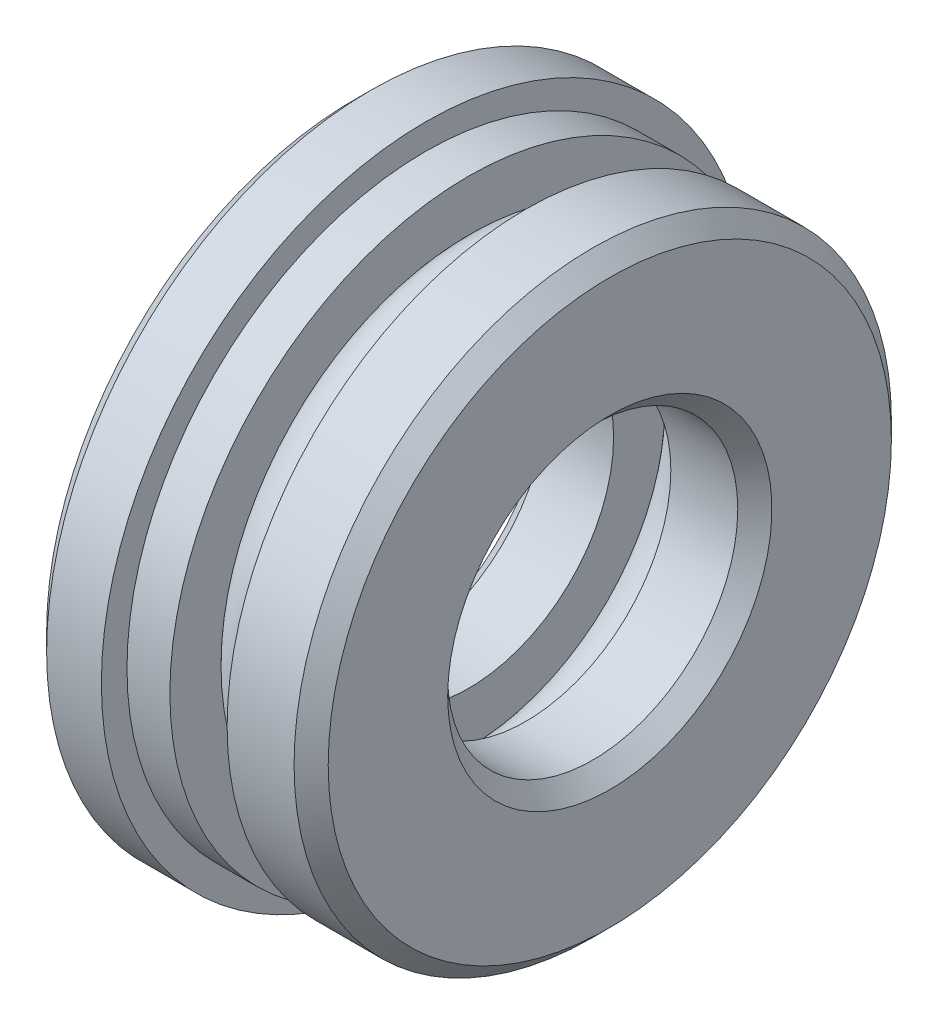
ISO-10303-21;
HEADER;
FILE_DESCRIPTION(('STEP AP214'),'2;1');
FILE_NAME('part.step','',(''),(''),'','','');
FILE_SCHEMA(('AUTOMOTIVE_DESIGN { 1 0 10303 214 1 1 1 1 }'));
ENDSEC;
DATA;
#1=APPLICATION_CONTEXT('core data for automotive mechanical design processes');
#2=APPLICATION_PROTOCOL_DEFINITION('international standard','automotive_design',2000,#1);
#3=PRODUCT_CONTEXT('',#1,'mechanical');
#4=PRODUCT('Part','Part','',(#3));
#5=PRODUCT_RELATED_PRODUCT_CATEGORY('part','',(#4));
#6=PRODUCT_DEFINITION_FORMATION('','',#4);
#7=PRODUCT_DEFINITION_CONTEXT('part definition',#1,'design');
#8=PRODUCT_DEFINITION('design','',#6,#7);
#9=PRODUCT_DEFINITION_SHAPE('','',#8);
#10=(LENGTH_UNIT() NAMED_UNIT(*) SI_UNIT(.MILLI.,.METRE.));
#11=(NAMED_UNIT(*) PLANE_ANGLE_UNIT() SI_UNIT($,.RADIAN.));
#12=(NAMED_UNIT(*) SI_UNIT($,.STERADIAN.) SOLID_ANGLE_UNIT());
#13=UNCERTAINTY_MEASURE_WITH_UNIT(LENGTH_MEASURE(1.E-05),#10,'distance_accuracy_value','');
#14=(GEOMETRIC_REPRESENTATION_CONTEXT(3) GLOBAL_UNCERTAINTY_ASSIGNED_CONTEXT((#13)) GLOBAL_UNIT_ASSIGNED_CONTEXT((#10,
#11,#12)) REPRESENTATION_CONTEXT('',''));
#15=CARTESIAN_POINT('',(0.,0.,0.));
#16=DIRECTION('',(0.,0.,1.));
#17=DIRECTION('',(1.,0.,0.));
#18=AXIS2_PLACEMENT_3D('',#15,#16,#17);
#19=CARTESIAN_POINT('',(8.4,-0.0133040110590031,0.));
#20=DIRECTION('',(-1.,0.,0.));
#21=DIRECTION('',(0.,0.,1.));
#22=AXIS2_PLACEMENT_3D('',#19,#20,#21);
#23=TOROIDAL_SURFACE('',#22,13.,2.25);
#24=CARTESIAN_POINT('',(10.0770509831248,-0.0133040110590031,0.));
#25=DIRECTION('',(-1.,0.,0.));
#26=DIRECTION('',(0.,0.,1.));
#27=AXIS2_PLACEMENT_3D('',#24,#25,#26);
#28=CIRCLE('',#27,11.5);
#29=CARTESIAN_POINT('',(10.0770509831248,-0.0133040110590031,11.5));
#30=VERTEX_POINT('',#29);
#31=EDGE_CURVE('E11',#30,#30,#28,.T.);
#32=ORIENTED_EDGE('',*,*,#31,.F.);
#33=EDGE_LOOP('',(#32));
#34=FACE_BOUND('',#33,.T.);
#35=CARTESIAN_POINT('',(10.0770509831248,-0.0133040110590031,0.));
#36=DIRECTION('',(-1.,0.,0.));
#37=DIRECTION('',(0.,0.,1.));
#38=AXIS2_PLACEMENT_3D('',#35,#36,#37);
#39=CIRCLE('',#38,14.5);
#40=CARTESIAN_POINT('',(10.0770509831248,-0.0133040110590031,14.5));
#41=VERTEX_POINT('',#40);
#42=EDGE_CURVE('E63',#41,#41,#39,.T.);
#43=ORIENTED_EDGE('',*,*,#42,.T.);
#44=EDGE_LOOP('',(#43));
#45=FACE_BOUND('',#44,.T.);
#46=ADVANCED_FACE('F35',(#34,#45),#23,.F.);
#47=CARTESIAN_POINT('',(10.0770509831248,11.486695988941,0.));
#48=DIRECTION('',(1.,0.,0.));
#49=DIRECTION('',(0.,0.,-1.));
#50=AXIS2_PLACEMENT_3D('',#47,#48,#49);
#51=PLANE('',#50);
#52=CARTESIAN_POINT('',(10.0770509831248,-0.0133040110590031,0.));
#53=DIRECTION('',(-1.,0.,0.));
#54=DIRECTION('',(0.,0.,1.));
#55=AXIS2_PLACEMENT_3D('',#52,#53,#54);
#56=CIRCLE('',#55,8.5);
#57=CARTESIAN_POINT('',(10.0770509831248,-0.0133040110590031,8.5));
#58=VERTEX_POINT('',#57);
#59=EDGE_CURVE('E41',#58,#58,#56,.T.);
#60=ORIENTED_EDGE('',*,*,#59,.F.);
#61=EDGE_LOOP('',(#60));
#62=FACE_BOUND('',#61,.T.);
#63=ORIENTED_EDGE('',*,*,#31,.T.);
#64=EDGE_LOOP('',(#63));
#65=FACE_BOUND('',#64,.T.);
#66=ADVANCED_FACE('F100',(#62,#65),#51,.F.);
#67=CARTESIAN_POINT('',(1.80000000000001,-0.0133040110590031,0.));
#68=DIRECTION('',(-1.,0.,0.));
#69=DIRECTION('',(0.,0.,1.));
#70=AXIS2_PLACEMENT_3D('',#67,#68,#69);
#71=CYLINDRICAL_SURFACE('',#70,8.5);
#72=CARTESIAN_POINT('',(14.,-0.0133040110590031,0.));
#73=DIRECTION('',(-1.,0.,0.));
#74=DIRECTION('',(0.,0.,1.));
#75=AXIS2_PLACEMENT_3D('',#72,#73,#74);
#76=CIRCLE('',#75,8.5);
#77=CARTESIAN_POINT('',(14.,-0.0133040110590031,8.5));
#78=VERTEX_POINT('',#77);
#79=EDGE_CURVE('E45',#78,#78,#76,.T.);
#80=ORIENTED_EDGE('',*,*,#79,.F.);
#81=EDGE_LOOP('',(#80));
#82=FACE_BOUND('',#81,.T.);
#83=ORIENTED_EDGE('',*,*,#59,.T.);
#84=EDGE_LOOP('',(#83));
#85=FACE_BOUND('',#84,.T.);
#86=ADVANCED_FACE('F95',(#82,#85),#71,.F.);
#87=CARTESIAN_POINT('',(14.,-0.0133040110590031,0.));
#88=DIRECTION('',(1.,0.,0.));
#89=DIRECTION('',(0.,0.,-1.));
#90=AXIS2_PLACEMENT_3D('',#87,#88,#89);
#91=CONICAL_SURFACE('',#90,8.5,0.785398163397448);
#92=CARTESIAN_POINT('',(15.,-0.0133040110590031,0.));
#93=DIRECTION('',(-1.,0.,0.));
#94=DIRECTION('',(0.,0.,1.));
#95=AXIS2_PLACEMENT_3D('',#92,#93,#94);
#96=CIRCLE('',#95,9.50000000000002);
#97=CARTESIAN_POINT('',(15.,-0.0133040110590031,9.50000000000002));
#98=VERTEX_POINT('',#97);
#99=EDGE_CURVE('E49',#98,#98,#96,.T.);
#100=ORIENTED_EDGE('',*,*,#99,.F.);
#101=EDGE_LOOP('',(#100));
#102=FACE_BOUND('',#101,.T.);
#103=ORIENTED_EDGE('',*,*,#79,.T.);
#104=EDGE_LOOP('',(#103));
#105=FACE_BOUND('',#104,.T.);
#106=ADVANCED_FACE('F89',(#102,#105),#91,.F.);
#107=CARTESIAN_POINT('',(15.,9.48669598894101,0.));
#108=DIRECTION('',(-1.,0.,0.));
#109=DIRECTION('',(0.,0.,1.));
#110=AXIS2_PLACEMENT_3D('',#107,#108,#109);
#111=PLANE('',#110);
#112=CARTESIAN_POINT('',(15.,-0.0133040110590031,0.));
#113=DIRECTION('',(-1.,0.,0.));
#114=DIRECTION('',(0.,0.,1.));
#115=AXIS2_PLACEMENT_3D('',#112,#113,#114);
#116=CIRCLE('',#115,16.5);
#117=CARTESIAN_POINT('',(15.,-0.0133040110590031,16.5));
#118=VERTEX_POINT('',#117);
#119=EDGE_CURVE('E54',#118,#118,#116,.T.);
#120=ORIENTED_EDGE('',*,*,#119,.F.);
#121=EDGE_LOOP('',(#120));
#122=FACE_BOUND('',#121,.T.);
#123=ORIENTED_EDGE('',*,*,#99,.T.);
#124=EDGE_LOOP('',(#123));
#125=FACE_BOUND('',#124,.T.);
#126=ADVANCED_FACE('F83',(#122,#125),#111,.F.);
#127=CARTESIAN_POINT('',(15.,-0.0133040110590031,0.));
#128=DIRECTION('',(-1.,0.,0.));
#129=DIRECTION('',(0.,0.,1.));
#130=AXIS2_PLACEMENT_3D('',#127,#128,#129);
#131=CONICAL_SURFACE('',#130,16.5,0.785398163397445);
#132=CARTESIAN_POINT('',(14.,-0.0133040110590031,0.));
#133=DIRECTION('',(-1.,0.,0.));
#134=DIRECTION('',(0.,0.,1.));
#135=AXIS2_PLACEMENT_3D('',#132,#133,#134);
#136=CIRCLE('',#135,17.5);
#137=CARTESIAN_POINT('',(14.,-0.0133040110590031,17.5));
#138=VERTEX_POINT('',#137);
#139=EDGE_CURVE('E57',#138,#138,#136,.T.);
#140=ORIENTED_EDGE('',*,*,#139,.F.);
#141=EDGE_LOOP('',(#140));
#142=FACE_BOUND('',#141,.T.);
#143=ORIENTED_EDGE('',*,*,#119,.T.);
#144=EDGE_LOOP('',(#143));
#145=FACE_BOUND('',#144,.T.);
#146=ADVANCED_FACE('F77',(#142,#145),#131,.T.);
#147=CARTESIAN_POINT('',(1.80000000000001,-0.0133040110590031,0.));
#148=DIRECTION('',(-1.,0.,0.));
#149=DIRECTION('',(0.,0.,1.));
#150=AXIS2_PLACEMENT_3D('',#147,#148,#149);
#151=CYLINDRICAL_SURFACE('',#150,17.5);
#152=CARTESIAN_POINT('',(10.0770509831248,-0.0133040110590031,0.));
#153=DIRECTION('',(-1.,0.,0.));
#154=DIRECTION('',(0.,0.,1.));
#155=AXIS2_PLACEMENT_3D('',#152,#153,#154);
#156=CIRCLE('',#155,17.5);
#157=CARTESIAN_POINT('',(10.0770509831248,-0.0133040110590031,17.5));
#158=VERTEX_POINT('',#157);
#159=EDGE_CURVE('E60',#158,#158,#156,.T.);
#160=ORIENTED_EDGE('',*,*,#159,.F.);
#161=EDGE_LOOP('',(#160));
#162=FACE_BOUND('',#161,.T.);
#163=ORIENTED_EDGE('',*,*,#139,.T.);
#164=EDGE_LOOP('',(#163));
#165=FACE_BOUND('',#164,.T.);
#166=ADVANCED_FACE('F71',(#162,#165),#151,.T.);
#167=CARTESIAN_POINT('',(10.0770509831248,14.486695988941,0.));
#168=DIRECTION('',(1.,0.,0.));
#169=DIRECTION('',(0.,0.,-1.));
#170=AXIS2_PLACEMENT_3D('',#167,#168,#169);
#171=PLANE('',#170);
#172=ORIENTED_EDGE('',*,*,#42,.F.);
#173=EDGE_LOOP('',(#172));
#174=FACE_BOUND('',#173,.T.);
#175=ORIENTED_EDGE('',*,*,#159,.T.);
#176=EDGE_LOOP('',(#175));
#177=FACE_BOUND('',#176,.T.);
#178=ADVANCED_FACE('F68',(#174,#177),#171,.F.);
#179=CLOSED_SHELL('',(#46,#66,#86,#106,#126,#146,#166,#178));
#180=MANIFOLD_SOLID_BREP('B2',#179);
#181=CARTESIAN_POINT('',(8.4,-0.0133040110590031,0.));
#182=DIRECTION('',(-1.,0.,0.));
#183=DIRECTION('',(0.,0.,1.));
#184=AXIS2_PLACEMENT_3D('',#181,#182,#183);
#185=TOROIDAL_SURFACE('',#184,13.,2.25);
#186=CARTESIAN_POINT('',(8.4,-0.0133040110590031,15.25));
#187=VERTEX_POINT('',#186);
#188=VERTEX_LOOP('',#187);
#189=FACE_BOUND('',#188,.T.);
#190=ADVANCED_FACE('F164',(#189),#185,.T.);
#191=CLOSED_SHELL('',(#190));
#192=MANIFOLD_SOLID_BREP('B6',#191);
#193=CARTESIAN_POINT('',(31.,-0.0133040110590031,0.));
#194=DIRECTION('',(-1.,0.,0.));
#195=DIRECTION('',(0.,1.,0.));
#196=AXIS2_PLACEMENT_3D('',#193,#194,#195);
#197=SPHERICAL_SURFACE('',#196,32.);
#198=CARTESIAN_POINT('',(1.80000000000001,-0.0133040110590031,0.));
#199=DIRECTION('',(-1.,0.,0.));
#200=DIRECTION('',(0.,0.,1.));
#201=AXIS2_PLACEMENT_3D('',#198,#199,#200);
#202=CIRCLE('',#201,13.0904545375629);
#203=CARTESIAN_POINT('',(1.80000000000001,13.0771505265039,0.));
#204=VERTEX_POINT('',#203);
#205=EDGE_CURVE('E163',#204,#204,#202,.T.);
#206=CARTESIAN_POINT('',(4.20914335076239,-0.0133040110590031,0.));
#207=DIRECTION('',(-1.,0.,0.));
#208=DIRECTION('',(0.,0.,1.));
#209=AXIS2_PLACEMENT_3D('',#206,#207,#208);
#210=CIRCLE('',#209,17.5);
#211=CARTESIAN_POINT('',(4.20914335076239,17.486695988941,0.));
#212=VERTEX_POINT('',#211);
#213=EDGE_CURVE('E211',#212,#212,#210,.T.);
#214=CARTESIAN_POINT('',(1.80000000000001,13.0771505265039,0.));
#215=CARTESIAN_POINT('',(1.8214335796401,13.124960979485,0.));
#216=CARTESIAN_POINT('',(1.84298458452997,13.1727187903362,0.));
#217=CARTESIAN_POINT('',(1.88632092036724,13.2681279775024,0.));
#218=CARTESIAN_POINT('',(1.90810625131463,13.3157793538175,0.));
#219=CARTESIAN_POINT('',(1.95191071482488,13.4109745216357,0.));
#220=CARTESIAN_POINT('',(1.97392984738773,13.4585183131388,0.));
#221=CARTESIAN_POINT('',(2.01820138253074,13.5534971643409,0.));
#222=CARTESIAN_POINT('',(2.0404537851109,13.60093222404,0.));
#223=CARTESIAN_POINT('',(2.08519132346794,13.6956924670813,0.));
#224=CARTESIAN_POINT('',(2.10767645924481,13.7430176504234,0.));
#225=CARTESIAN_POINT('',(2.15287892145055,13.8375569988984,0.));
#226=CARTESIAN_POINT('',(2.1755962478794,13.8847711640312,0.));
#227=CARTESIAN_POINT('',(2.22126254327121,13.9790873369005,0.));
#228=CARTESIAN_POINT('',(2.24421151223416,14.0261893446369,0.));
#229=CARTESIAN_POINT('',(2.29034053897936,14.1202800662361,0.));
#230=CARTESIAN_POINT('',(2.31352059676162,14.1672687800989,0.));
#231=CARTESIAN_POINT('',(2.36011124185704,14.261131780206,0.));
#232=CARTESIAN_POINT('',(2.38352182917021,14.3080060664504,0.));
#233=CARTESIAN_POINT('',(2.43057296847626,14.4016390803371,0.));
#234=CARTESIAN_POINT('',(2.45421352046915,14.4483978079796,0.));
#235=CARTESIAN_POINT('',(2.50172401873504,14.541798576467,0.));
#236=CARTESIAN_POINT('',(2.52559396500803,14.588440617312,0.));
#237=CARTESIAN_POINT('',(2.57356267589963,14.6816068868248,0.));
#238=CARTESIAN_POINT('',(2.59766144051824,14.7281311154924,0.));
#239=CARTESIAN_POINT('',(2.64608720664564,14.821060638113,0.));
#240=CARTESIAN_POINT('',(2.67041420815444,14.867465932066,0.));
#241=CARTESIAN_POINT('',(2.7192958610999,14.9601564655893,0.));
#242=CARTESIAN_POINT('',(2.74385051253657,15.0064417051597,0.));
#243=CARTESIAN_POINT('',(2.79318687288271,15.0988910131469,0.));
#244=CARTESIAN_POINT('',(2.81796858179219,15.1450550815637,0.));
#245=CARTESIAN_POINT('',(2.86775845915044,15.2372609333963,0.));
#246=CARTESIAN_POINT('',(2.89276662759921,15.283302716812,0.));
#247=CARTESIAN_POINT('',(2.94300882063853,15.3752628877455,0.));
#248=CARTESIAN_POINT('',(2.96824284522908,15.4211812752633,0.));
#249=CARTESIAN_POINT('',(3.01893614170494,15.5128935464811,0.));
#250=CARTESIAN_POINT('',(3.04439541359026,15.5586874301811,0.));
#251=CARTESIAN_POINT('',(3.09553859037392,15.6501495888479,0.));
#252=CARTESIAN_POINT('',(3.12122249527226,15.6958178638147,0.));
#253=CARTESIAN_POINT('',(3.17281431838023,15.7870277031299,0.));
#254=CARTESIAN_POINT('',(3.19872223658987,15.8325692674784,0.));
#255=CARTESIAN_POINT('',(3.25076146121376,15.9235245867295,0.));
#256=CARTESIAN_POINT('',(3.276892767628,15.9689383416321,0.));
#257=CARTESIAN_POINT('',(3.32937813816446,16.0596369462474,0.));
#258=CARTESIAN_POINT('',(3.35573220228667,16.1049217959602,0.));
#259=CARTESIAN_POINT('',(3.40866245236776,16.1953614975622,0.));
#260=CARTESIAN_POINT('',(3.43523863832663,16.2405163494516,0.));
#261=CARTESIAN_POINT('',(3.48861249085032,16.3306949659097,0.));
#262=CARTESIAN_POINT('',(3.51541015741514,16.3757187304785,0.));
#263=CARTESIAN_POINT('',(3.56922632457626,16.4656340859613,0.));
#264=CARTESIAN_POINT('',(3.59624482517256,16.5105256768753,0.));
#265=CARTESIAN_POINT('',(3.65050200849337,16.6001756019038,0.));
#266=CARTESIAN_POINT('',(3.67774069121789,16.6449339360183,0.));
#267=CARTESIAN_POINT('',(3.73243758158123,16.7343162675167,0.));
#268=CARTESIAN_POINT('',(3.75989578922007,16.7789402649007,0.));
#269=CARTESIAN_POINT('',(3.81503106689425,16.8680528462532,0.));
#270=CARTESIAN_POINT('',(3.84270813692961,16.9125414302218,0.));
#271=CARTESIAN_POINT('',(3.89828047162521,17.0013821113086,0.));
#272=CARTESIAN_POINT('',(3.92617573628545,17.0457342084268,0.));
#273=CARTESIAN_POINT('',(3.98218378709425,17.1343008457357,0.));
#274=CARTESIAN_POINT('',(4.01029657324282,17.1785153859264,0.));
#275=CARTESIAN_POINT('',(4.06673898901778,17.2668058423803,0.));
#276=CARTESIAN_POINT('',(4.09506861864419,17.3108817586435,0.));
#277=CARTESIAN_POINT('',(4.15194403673487,17.3988939044901,0.));
#278=CARTESIAN_POINT('',(4.18048982519915,17.4428301340736,0.));
#279=CARTESIAN_POINT('',(4.20914335076239,17.486695988941,0.));
#280=B_SPLINE_CURVE_WITH_KNOTS('',3,(#214,#215,#216,#217,#218,#219,#220,#221,#222,#223,#224,
#225,#226,#227,#228,#229,#230,#231,#232,#233,#234,#235,#236,#237,#238,#239,#240,#241,#242,#243,
#244,#245,#246,#247,#248,#249,#250,#251,#252,#253,#254,#255,#256,#257,#258,#259,#260,#261,#262,
#263,#264,#265,#266,#267,#268,#269,#270,#271,#272,#273,#274,#275,#276,#277,#278,#279),
.UNSPECIFIED.,.F.,.F.,(4,2,2,2,2,2,2,2,2,2,2,2,2,2,2,2,2,2,2,2,2,2,2,2,2,2,2,2,2,2,2,2,4),(0.,
0.157184891357785,0.314369782715567,0.471554674073345,0.628739565431128,0.785924456788912,
0.943109348146689,1.10029423950447,1.25747913086226,1.41466402222004,1.57184891357782,
1.7290338049356,1.88621869629339,2.04340358765117,2.20058847900894,2.35777337036673,
2.51495826172451,2.67214315308229,2.82932804444008,2.98651293579786,3.14369782715564,
3.30088271851342,3.4580676098712,3.61525250122898,3.77243739258677,3.92962228394455,
4.08680717530233,4.24399206666011,4.40117695801789,4.55836184937568,4.71554674073345,
4.87273163209124,5.02991652344902),.UNSPECIFIED.);
#281=EDGE_CURVE('BSEAM183',#204,#212,#280,.T.);
#282=ORIENTED_EDGE('',*,*,#205,.F.);
#283=ORIENTED_EDGE('',*,*,#213,.T.);
#284=ORIENTED_EDGE('',*,*,#281,.T.);
#285=ORIENTED_EDGE('',*,*,#281,.F.);
#286=EDGE_LOOP('',(#282,#284,#283,#285));
#287=FACE_BOUND('',#286,.T.);
#288=ADVANCED_FACE('F183',(#287),#197,.T.);
#289=CARTESIAN_POINT('',(1.80000000000001,9.48669598894099,0.));
#290=DIRECTION('',(1.,0.,0.));
#291=DIRECTION('',(0.,0.,-1.));
#292=AXIS2_PLACEMENT_3D('',#289,#290,#291);
#293=PLANE('',#292);
#294=CARTESIAN_POINT('',(1.80000000000001,-0.0133040110590031,0.));
#295=DIRECTION('',(-1.,0.,0.));
#296=DIRECTION('',(0.,0.,1.));
#297=AXIS2_PLACEMENT_3D('',#294,#295,#296);
#298=CIRCLE('',#297,9.49999999999999);
#299=CARTESIAN_POINT('',(1.80000000000001,-0.0133040110590031,9.49999999999999));
#300=VERTEX_POINT('',#299);
#301=EDGE_CURVE('E189',#300,#300,#298,.T.);
#302=ORIENTED_EDGE('',*,*,#301,.F.);
#303=EDGE_LOOP('',(#302));
#304=FACE_BOUND('',#303,.T.);
#305=ORIENTED_EDGE('',*,*,#205,.T.);
#306=EDGE_LOOP('',(#305));
#307=FACE_BOUND('',#306,.T.);
#308=ADVANCED_FACE('F248',(#304,#307),#293,.F.);
#309=CARTESIAN_POINT('',(1.80000000000001,-0.0133040110590031,0.));
#310=DIRECTION('',(-1.,0.,0.));
#311=DIRECTION('',(0.,0.,1.));
#312=AXIS2_PLACEMENT_3D('',#309,#310,#311);
#313=CONICAL_SURFACE('',#312,9.49999999999999,0.785398163397448);
#314=CARTESIAN_POINT('',(2.8,-0.0133040110590031,0.));
#315=DIRECTION('',(-1.,0.,0.));
#316=DIRECTION('',(0.,0.,1.));
#317=AXIS2_PLACEMENT_3D('',#314,#315,#316);
#318=CIRCLE('',#317,8.5);
#319=CARTESIAN_POINT('',(2.8,-0.0133040110590031,8.5));
#320=VERTEX_POINT('',#319);
#321=EDGE_CURVE('E193',#320,#320,#318,.T.);
#322=ORIENTED_EDGE('',*,*,#321,.F.);
#323=EDGE_LOOP('',(#322));
#324=FACE_BOUND('',#323,.T.);
#325=ORIENTED_EDGE('',*,*,#301,.T.);
#326=EDGE_LOOP('',(#325));
#327=FACE_BOUND('',#326,.T.);
#328=ADVANCED_FACE('F243',(#324,#327),#313,.F.);
#329=CARTESIAN_POINT('',(1.80000000000001,-0.0133040110590031,0.));
#330=DIRECTION('',(-1.,0.,0.));
#331=DIRECTION('',(0.,0.,1.));
#332=AXIS2_PLACEMENT_3D('',#329,#330,#331);
#333=CYLINDRICAL_SURFACE('',#332,8.5);
#334=CARTESIAN_POINT('',(6.72294901687516,-0.0133040110590031,0.));
#335=DIRECTION('',(-1.,0.,0.));
#336=DIRECTION('',(0.,0.,1.));
#337=AXIS2_PLACEMENT_3D('',#334,#335,#336);
#338=CIRCLE('',#337,8.5);
#339=CARTESIAN_POINT('',(6.72294901687516,-0.0133040110590031,8.5));
#340=VERTEX_POINT('',#339);
#341=EDGE_CURVE('E197',#340,#340,#338,.T.);
#342=ORIENTED_EDGE('',*,*,#341,.F.);
#343=EDGE_LOOP('',(#342));
#344=FACE_BOUND('',#343,.T.);
#345=ORIENTED_EDGE('',*,*,#321,.T.);
#346=EDGE_LOOP('',(#345));
#347=FACE_BOUND('',#346,.T.);
#348=ADVANCED_FACE('F237',(#344,#347),#333,.F.);
#349=CARTESIAN_POINT('',(6.72294901687516,11.486695988941,0.));
#350=DIRECTION('',(-1.,0.,0.));
#351=DIRECTION('',(0.,0.,1.));
#352=AXIS2_PLACEMENT_3D('',#349,#350,#351);
#353=PLANE('',#352);
#354=CARTESIAN_POINT('',(6.72294901687516,-0.0133040110590031,0.));
#355=DIRECTION('',(-1.,0.,0.));
#356=DIRECTION('',(0.,0.,1.));
#357=AXIS2_PLACEMENT_3D('',#354,#355,#356);
#358=CIRCLE('',#357,11.5);
#359=CARTESIAN_POINT('',(6.72294901687516,-0.0133040110590031,11.5));
#360=VERTEX_POINT('',#359);
#361=EDGE_CURVE('E202',#360,#360,#358,.T.);
#362=ORIENTED_EDGE('',*,*,#361,.F.);
#363=EDGE_LOOP('',(#362));
#364=FACE_BOUND('',#363,.T.);
#365=ORIENTED_EDGE('',*,*,#341,.T.);
#366=EDGE_LOOP('',(#365));
#367=FACE_BOUND('',#366,.T.);
#368=ADVANCED_FACE('F231',(#364,#367),#353,.F.);
#369=CARTESIAN_POINT('',(8.4,-0.0133040110590031,0.));
#370=DIRECTION('',(-1.,0.,0.));
#371=DIRECTION('',(0.,0.,1.));
#372=AXIS2_PLACEMENT_3D('',#369,#370,#371);
#373=TOROIDAL_SURFACE('',#372,13.,2.25);
#374=CARTESIAN_POINT('',(6.72294901687516,-0.0133040110590031,0.));
#375=DIRECTION('',(-1.,0.,0.));
#376=DIRECTION('',(0.,0.,1.));
#377=AXIS2_PLACEMENT_3D('',#374,#375,#376);
#378=CIRCLE('',#377,14.5);
#379=CARTESIAN_POINT('',(6.72294901687516,-0.0133040110590031,14.5));
#380=VERTEX_POINT('',#379);
#381=EDGE_CURVE('E205',#380,#380,#378,.T.);
#382=ORIENTED_EDGE('',*,*,#381,.F.);
#383=EDGE_LOOP('',(#382));
#384=FACE_BOUND('',#383,.T.);
#385=ORIENTED_EDGE('',*,*,#361,.T.);
#386=EDGE_LOOP('',(#385));
#387=FACE_BOUND('',#386,.T.);
#388=ADVANCED_FACE('F225',(#384,#387),#373,.F.);
#389=CARTESIAN_POINT('',(6.72294901687516,14.486695988941,0.));
#390=DIRECTION('',(-1.,0.,0.));
#391=DIRECTION('',(0.,0.,1.));
#392=AXIS2_PLACEMENT_3D('',#389,#390,#391);
#393=PLANE('',#392);
#394=CARTESIAN_POINT('',(6.72294901687516,-0.0133040110590031,0.));
#395=DIRECTION('',(-1.,0.,0.));
#396=DIRECTION('',(0.,0.,1.));
#397=AXIS2_PLACEMENT_3D('',#394,#395,#396);
#398=CIRCLE('',#397,17.5);
#399=CARTESIAN_POINT('',(6.72294901687516,-0.0133040110590031,17.5));
#400=VERTEX_POINT('',#399);
#401=EDGE_CURVE('E208',#400,#400,#398,.T.);
#402=ORIENTED_EDGE('',*,*,#401,.F.);
#403=EDGE_LOOP('',(#402));
#404=FACE_BOUND('',#403,.T.);
#405=ORIENTED_EDGE('',*,*,#381,.T.);
#406=EDGE_LOOP('',(#405));
#407=FACE_BOUND('',#406,.T.);
#408=ADVANCED_FACE('F219',(#404,#407),#393,.F.);
#409=CARTESIAN_POINT('',(1.80000000000001,-0.0133040110590031,0.));
#410=DIRECTION('',(-1.,0.,0.));
#411=DIRECTION('',(0.,0.,1.));
#412=AXIS2_PLACEMENT_3D('',#409,#410,#411);
#413=CYLINDRICAL_SURFACE('',#412,17.5);
#414=ORIENTED_EDGE('',*,*,#213,.F.);
#415=EDGE_LOOP('',(#414));
#416=FACE_BOUND('',#415,.T.);
#417=ORIENTED_EDGE('',*,*,#401,.T.);
#418=EDGE_LOOP('',(#417));
#419=FACE_BOUND('',#418,.T.);
#420=ADVANCED_FACE('F216',(#416,#419),#413,.T.);
#421=CLOSED_SHELL('',(#288,#308,#328,#348,#368,#388,#408,#420));
#422=MANIFOLD_SOLID_BREP('B31',#421);
#423=CARTESIAN_POINT('',(31.,-0.0133040110590031,0.));
#424=DIRECTION('',(-1.,0.,0.));
#425=DIRECTION('',(0.,1.,0.));
#426=AXIS2_PLACEMENT_3D('',#423,#424,#425);
#427=SPHERICAL_SURFACE('',#426,32.);
#428=CARTESIAN_POINT('',(4.20914335076239,-0.0133040110590031,0.));
#429=DIRECTION('',(-1.,0.,0.));
#430=DIRECTION('',(0.,0.,1.));
#431=AXIS2_PLACEMENT_3D('',#428,#429,#430);
#432=CIRCLE('',#431,17.5);
#433=CARTESIAN_POINT('',(4.20914335076239,17.486695988941,0.));
#434=VERTEX_POINT('',#433);
#435=EDGE_CURVE('E182',#434,#434,#432,.T.);
#436=CARTESIAN_POINT('',(1.80000000000001,-0.0133040110590031,0.));
#437=DIRECTION('',(-1.,0.,0.));
#438=DIRECTION('',(0.,0.,1.));
#439=AXIS2_PLACEMENT_3D('',#436,#437,#438);
#440=CIRCLE('',#439,13.0904545375629);
#441=CARTESIAN_POINT('',(1.80000000000001,13.0771505265039,0.));
#442=VERTEX_POINT('',#441);
#443=EDGE_CURVE('E326',#442,#442,#440,.T.);
#444=CARTESIAN_POINT('',(4.20914335076239,17.486695988941,0.));
#445=CARTESIAN_POINT('',(4.18048982519915,17.4428301340736,0.));
#446=CARTESIAN_POINT('',(4.15194403673487,17.3988939044901,0.));
#447=CARTESIAN_POINT('',(4.09506861864419,17.3108817586435,0.));
#448=CARTESIAN_POINT('',(4.06673898901778,17.2668058423803,0.));
#449=CARTESIAN_POINT('',(4.01029657324282,17.1785153859264,0.));
#450=CARTESIAN_POINT('',(3.98218378709425,17.1343008457357,0.));
#451=CARTESIAN_POINT('',(3.92617573628545,17.0457342084268,0.));
#452=CARTESIAN_POINT('',(3.89828047162521,17.0013821113086,0.));
#453=CARTESIAN_POINT('',(3.84270813692961,16.9125414302218,0.));
#454=CARTESIAN_POINT('',(3.81503106689425,16.8680528462532,0.));
#455=CARTESIAN_POINT('',(3.75989578922007,16.7789402649007,0.));
#456=CARTESIAN_POINT('',(3.73243758158123,16.7343162675167,0.));
#457=CARTESIAN_POINT('',(3.67774069121789,16.6449339360183,0.));
#458=CARTESIAN_POINT('',(3.65050200849337,16.6001756019038,0.));
#459=CARTESIAN_POINT('',(3.59624482517256,16.5105256768753,0.));
#460=CARTESIAN_POINT('',(3.56922632457626,16.4656340859613,0.));
#461=CARTESIAN_POINT('',(3.51541015741514,16.3757187304785,0.));
#462=CARTESIAN_POINT('',(3.48861249085032,16.3306949659097,0.));
#463=CARTESIAN_POINT('',(3.43523863832663,16.2405163494516,0.));
#464=CARTESIAN_POINT('',(3.40866245236776,16.1953614975622,0.));
#465=CARTESIAN_POINT('',(3.35573220228667,16.1049217959602,0.));
#466=CARTESIAN_POINT('',(3.32937813816446,16.0596369462474,0.));
#467=CARTESIAN_POINT('',(3.276892767628,15.9689383416321,0.));
#468=CARTESIAN_POINT('',(3.25076146121376,15.9235245867295,0.));
#469=CARTESIAN_POINT('',(3.19872223658987,15.8325692674784,0.));
#470=CARTESIAN_POINT('',(3.17281431838023,15.7870277031299,0.));
#471=CARTESIAN_POINT('',(3.12122249527226,15.6958178638147,0.));
#472=CARTESIAN_POINT('',(3.09553859037392,15.6501495888479,0.));
#473=CARTESIAN_POINT('',(3.04439541359026,15.5586874301811,0.));
#474=CARTESIAN_POINT('',(3.01893614170494,15.5128935464811,0.));
#475=CARTESIAN_POINT('',(2.96824284522908,15.4211812752633,0.));
#476=CARTESIAN_POINT('',(2.94300882063853,15.3752628877455,0.));
#477=CARTESIAN_POINT('',(2.89276662759921,15.283302716812,0.));
#478=CARTESIAN_POINT('',(2.86775845915044,15.2372609333963,0.));
#479=CARTESIAN_POINT('',(2.81796858179219,15.1450550815637,0.));
#480=CARTESIAN_POINT('',(2.79318687288271,15.0988910131469,0.));
#481=CARTESIAN_POINT('',(2.74385051253657,15.0064417051597,0.));
#482=CARTESIAN_POINT('',(2.7192958610999,14.9601564655893,0.));
#483=CARTESIAN_POINT('',(2.67041420815444,14.867465932066,0.));
#484=CARTESIAN_POINT('',(2.64608720664564,14.821060638113,0.));
#485=CARTESIAN_POINT('',(2.59766144051824,14.7281311154924,0.));
#486=CARTESIAN_POINT('',(2.57356267589963,14.6816068868248,0.));
#487=CARTESIAN_POINT('',(2.52559396500803,14.588440617312,0.));
#488=CARTESIAN_POINT('',(2.50172401873504,14.541798576467,0.));
#489=CARTESIAN_POINT('',(2.45421352046915,14.4483978079796,0.));
#490=CARTESIAN_POINT('',(2.43057296847626,14.4016390803371,0.));
#491=CARTESIAN_POINT('',(2.3835218291702,14.3080060664504,0.));
#492=CARTESIAN_POINT('',(2.36011124185704,14.261131780206,0.));
#493=CARTESIAN_POINT('',(2.31352059676162,14.1672687800989,0.));
#494=CARTESIAN_POINT('',(2.29034053897936,14.1202800662361,0.));
#495=CARTESIAN_POINT('',(2.24421151223416,14.0261893446369,0.));
#496=CARTESIAN_POINT('',(2.22126254327121,13.9790873369005,0.));
#497=CARTESIAN_POINT('',(2.1755962478794,13.8847711640312,0.));
#498=CARTESIAN_POINT('',(2.15287892145055,13.8375569988984,0.));
#499=CARTESIAN_POINT('',(2.10767645924481,13.7430176504234,0.));
#500=CARTESIAN_POINT('',(2.08519132346794,13.6956924670813,0.));
#501=CARTESIAN_POINT('',(2.0404537851109,13.60093222404,0.));
#502=CARTESIAN_POINT('',(2.01820138253074,13.5534971643409,0.));
#503=CARTESIAN_POINT('',(1.97392984738773,13.4585183131388,0.));
#504=CARTESIAN_POINT('',(1.95191071482488,13.4109745216357,0.));
#505=CARTESIAN_POINT('',(1.90810625131463,13.3157793538175,0.));
#506=CARTESIAN_POINT('',(1.88632092036724,13.2681279775024,0.));
#507=CARTESIAN_POINT('',(1.84298458452997,13.1727187903362,0.));
#508=CARTESIAN_POINT('',(1.8214335796401,13.124960979485,0.));
#509=CARTESIAN_POINT('',(1.80000000000001,13.0771505265039,0.));
#510=B_SPLINE_CURVE_WITH_KNOTS('',3,(#444,#445,#446,#447,#448,#449,#450,#451,#452,#453,#454,
#455,#456,#457,#458,#459,#460,#461,#462,#463,#464,#465,#466,#467,#468,#469,#470,#471,#472,#473,
#474,#475,#476,#477,#478,#479,#480,#481,#482,#483,#484,#485,#486,#487,#488,#489,#490,#491,#492,
#493,#494,#495,#496,#497,#498,#499,#500,#501,#502,#503,#504,#505,#506,#507,#508,#509),
.UNSPECIFIED.,.F.,.F.,(4,2,2,2,2,2,2,2,2,2,2,2,2,2,2,2,2,2,2,2,2,2,2,2,2,2,2,2,2,2,2,2,4),(0.,
0.157184891357782,0.314369782715568,0.471554674073344,0.628739565431127,0.785924456788909,
0.943109348146686,1.10029423950447,1.25747913086225,1.41466402222004,1.57184891357782,
1.7290338049356,1.88621869629338,2.04340358765116,2.20058847900894,2.35777337036672,
2.51495826172451,2.67214315308229,2.82932804444008,2.98651293579785,3.14369782715563,
3.30088271851342,3.4580676098712,3.61525250122898,3.77243739258676,3.92962228394455,
4.08680717530233,4.24399206666011,4.40117695801789,4.55836184937567,4.71554674073345,
4.87273163209123,5.02991652344902),.UNSPECIFIED.);
#511=EDGE_CURVE('BSEAM304',#434,#442,#510,.T.);
#512=ORIENTED_EDGE('',*,*,#435,.F.);
#513=ORIENTED_EDGE('',*,*,#443,.T.);
#514=ORIENTED_EDGE('',*,*,#511,.T.);
#515=ORIENTED_EDGE('',*,*,#511,.F.);
#516=EDGE_LOOP('',(#512,#514,#513,#515));
#517=FACE_BOUND('',#516,.T.);
#518=ADVANCED_FACE('F304',(#517),#427,.F.);
#519=CARTESIAN_POINT('',(4.20914335076239,17.486695988941,0.));
#520=DIRECTION('',(-1.,0.,0.));
#521=DIRECTION('',(0.,0.,1.));
#522=AXIS2_PLACEMENT_3D('',#519,#520,#521);
#523=PLANE('',#522);
#524=CARTESIAN_POINT('',(4.20914335076239,-0.0133040110590031,0.));
#525=DIRECTION('',(-1.,0.,0.));
#526=DIRECTION('',(0.,0.,1.));
#527=AXIS2_PLACEMENT_3D('',#524,#525,#526);
#528=CIRCLE('',#527,19.);
#529=CARTESIAN_POINT('',(4.20914335076239,-0.0133040110590031,19.));
#530=VERTEX_POINT('',#529);
#531=EDGE_CURVE('E310',#530,#530,#528,.T.);
#532=ORIENTED_EDGE('',*,*,#531,.F.);
#533=EDGE_LOOP('',(#532));
#534=FACE_BOUND('',#533,.T.);
#535=ORIENTED_EDGE('',*,*,#435,.T.);
#536=EDGE_LOOP('',(#535));
#537=FACE_BOUND('',#536,.T.);
#538=ADVANCED_FACE('F351',(#534,#537),#523,.F.);
#539=CARTESIAN_POINT('',(1.80000000000001,-0.0133040110590031,0.));
#540=DIRECTION('',(-1.,0.,0.));
#541=DIRECTION('',(0.,0.,1.));
#542=AXIS2_PLACEMENT_3D('',#539,#540,#541);
#543=CYLINDRICAL_SURFACE('',#542,19.);
#544=CARTESIAN_POINT('',(1.,-0.0133040110590031,0.));
#545=DIRECTION('',(-1.,0.,0.));
#546=DIRECTION('',(0.,0.,1.));
#547=AXIS2_PLACEMENT_3D('',#544,#545,#546);
#548=CIRCLE('',#547,19.);
#549=CARTESIAN_POINT('',(1.,-0.0133040110590031,19.));
#550=VERTEX_POINT('',#549);
#551=EDGE_CURVE('E314',#550,#550,#548,.T.);
#552=ORIENTED_EDGE('',*,*,#551,.F.);
#553=EDGE_LOOP('',(#552));
#554=FACE_BOUND('',#553,.T.);
#555=ORIENTED_EDGE('',*,*,#531,.T.);
#556=EDGE_LOOP('',(#555));
#557=FACE_BOUND('',#556,.T.);
#558=ADVANCED_FACE('F346',(#554,#557),#543,.T.);
#559=CARTESIAN_POINT('',(1.,-0.0133040110590031,0.));
#560=DIRECTION('',(1.,0.,0.));
#561=DIRECTION('',(0.,0.,-1.));
#562=AXIS2_PLACEMENT_3D('',#559,#560,#561);
#563=CONICAL_SURFACE('',#562,19.,0.785398163397448);
#564=CARTESIAN_POINT('',(0.,-0.0133040110590031,0.));
#565=DIRECTION('',(-1.,0.,0.));
#566=DIRECTION('',(0.,0.,1.));
#567=AXIS2_PLACEMENT_3D('',#564,#565,#566);
#568=CIRCLE('',#567,18.);
#569=CARTESIAN_POINT('',(0.,-0.0133040110590031,18.));
#570=VERTEX_POINT('',#569);
#571=EDGE_CURVE('E318',#570,#570,#568,.T.);
#572=ORIENTED_EDGE('',*,*,#571,.F.);
#573=EDGE_LOOP('',(#572));
#574=FACE_BOUND('',#573,.T.);
#575=ORIENTED_EDGE('',*,*,#551,.T.);
#576=EDGE_LOOP('',(#575));
#577=FACE_BOUND('',#576,.T.);
#578=ADVANCED_FACE('F340',(#574,#577),#563,.T.);
#579=CARTESIAN_POINT('',(0.,17.986695988941,0.));
#580=DIRECTION('',(1.,0.,0.));
#581=DIRECTION('',(0.,0.,-1.));
#582=AXIS2_PLACEMENT_3D('',#579,#580,#581);
#583=PLANE('',#582);
#584=CARTESIAN_POINT('',(0.,-0.0133040110590031,0.));
#585=DIRECTION('',(-1.,0.,0.));
#586=DIRECTION('',(0.,0.,1.));
#587=AXIS2_PLACEMENT_3D('',#584,#585,#586);
#588=CIRCLE('',#587,13.0904545375629);
#589=CARTESIAN_POINT('',(0.,-0.0133040110590031,13.0904545375629));
#590=VERTEX_POINT('',#589);
#591=EDGE_CURVE('E323',#590,#590,#588,.T.);
#592=ORIENTED_EDGE('',*,*,#591,.F.);
#593=EDGE_LOOP('',(#592));
#594=FACE_BOUND('',#593,.T.);
#595=ORIENTED_EDGE('',*,*,#571,.T.);
#596=EDGE_LOOP('',(#595));
#597=FACE_BOUND('',#596,.T.);
#598=ADVANCED_FACE('F334',(#594,#597),#583,.F.);
#599=CARTESIAN_POINT('',(1.80000000000001,-0.0133040110590031,0.));
#600=DIRECTION('',(-1.,0.,0.));
#601=DIRECTION('',(0.,0.,1.));
#602=AXIS2_PLACEMENT_3D('',#599,#600,#601);
#603=CYLINDRICAL_SURFACE('',#602,13.0904545375629);
#604=ORIENTED_EDGE('',*,*,#443,.F.);
#605=EDGE_LOOP('',(#604));
#606=FACE_BOUND('',#605,.T.);
#607=ORIENTED_EDGE('',*,*,#591,.T.);
#608=EDGE_LOOP('',(#607));
#609=FACE_BOUND('',#608,.T.);
#610=ADVANCED_FACE('F331',(#606,#609),#603,.F.);
#611=CLOSED_SHELL('',(#518,#538,#558,#578,#598,#610));
#612=MANIFOLD_SOLID_BREP('B158',#611);
#613=ADVANCED_BREP_SHAPE_REPRESENTATION('',(#18,#180,#192,#422,#612),#14);
#614=SHAPE_DEFINITION_REPRESENTATION(#9,#613);
ENDSEC;
END-ISO-10303-21;
